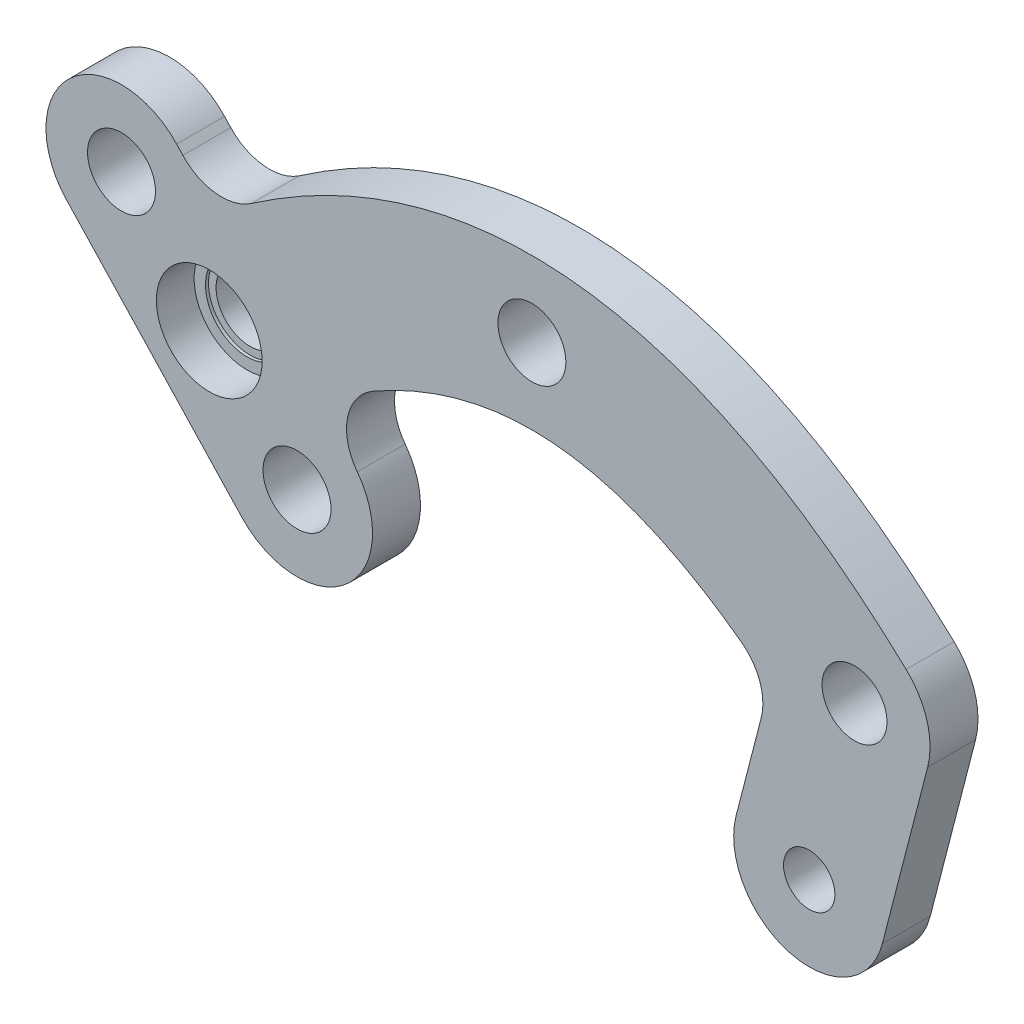
ISO-10303-21;
HEADER;
FILE_DESCRIPTION(('STEP AP214'),'2;1');
FILE_NAME('part.step','',(''),(''),'','','');
FILE_SCHEMA(('AUTOMOTIVE_DESIGN { 1 0 10303 214 1 1 1 1 }'));
ENDSEC;
DATA;
#1=APPLICATION_CONTEXT('core data for automotive mechanical design processes');
#2=APPLICATION_PROTOCOL_DEFINITION('international standard','automotive_design',2000,#1);
#3=PRODUCT_CONTEXT('',#1,'mechanical');
#4=PRODUCT('Part','Part','',(#3));
#5=PRODUCT_RELATED_PRODUCT_CATEGORY('part','',(#4));
#6=PRODUCT_DEFINITION_FORMATION('','',#4);
#7=PRODUCT_DEFINITION_CONTEXT('part definition',#1,'design');
#8=PRODUCT_DEFINITION('design','',#6,#7);
#9=PRODUCT_DEFINITION_SHAPE('','',#8);
#10=(LENGTH_UNIT() NAMED_UNIT(*) SI_UNIT(.MILLI.,.METRE.));
#11=(NAMED_UNIT(*) PLANE_ANGLE_UNIT() SI_UNIT($,.RADIAN.));
#12=(NAMED_UNIT(*) SI_UNIT($,.STERADIAN.) SOLID_ANGLE_UNIT());
#13=UNCERTAINTY_MEASURE_WITH_UNIT(LENGTH_MEASURE(1.E-05),#10,'distance_accuracy_value','');
#14=(GEOMETRIC_REPRESENTATION_CONTEXT(3) GLOBAL_UNCERTAINTY_ASSIGNED_CONTEXT((#13)) GLOBAL_UNIT_ASSIGNED_CONTEXT((#10,
#11,#12)) REPRESENTATION_CONTEXT('',''));
#15=CARTESIAN_POINT('',(0.,0.,0.));
#16=DIRECTION('',(0.,0.,1.));
#17=DIRECTION('',(1.,0.,0.));
#18=AXIS2_PLACEMENT_3D('',#15,#16,#17);
#19=CARTESIAN_POINT('',(0.,0.,-1.5875));
#20=DIRECTION('',(0.,0.,1.));
#21=DIRECTION('',(1.,0.,0.));
#22=AXIS2_PLACEMENT_3D('',#19,#20,#21);
#23=PLANE('',#22);
#24=CARTESIAN_POINT('',(21.36,-10.,-1.5875));
#25=DIRECTION('',(0.,0.,1.));
#26=DIRECTION('',(1.,0.,0.));
#27=AXIS2_PLACEMENT_3D('',#24,#25,#26);
#28=CIRCLE('',#27,2.75);
#29=CARTESIAN_POINT('',(24.11,-10.,-1.5875));
#30=VERTEX_POINT('',#29);
#31=EDGE_CURVE('E192',#30,#30,#28,.F.);
#32=ORIENTED_EDGE('',*,*,#31,.F.);
#33=EDGE_LOOP('',(#32));
#34=FACE_BOUND('',#33,.T.);
#35=CARTESIAN_POINT('',(18.36,-21.6189500386222,-1.5875));
#36=DIRECTION('',(0.,0.,-1.));
#37=DIRECTION('',(-1.,0.,0.));
#38=AXIS2_PLACEMENT_3D('',#35,#36,#37);
#39=CIRCLE('',#38,1.7);
#40=CARTESIAN_POINT('',(16.66,-21.6189500386222,-1.5875));
#41=VERTEX_POINT('',#40);
#42=EDGE_CURVE('E570',#41,#41,#39,.T.);
#43=ORIENTED_EDGE('',*,*,#42,.F.);
#44=EDGE_LOOP('',(#43));
#45=FACE_BOUND('',#44,.T.);
#46=DIRECTION('',(0.25,0.968245836551854,0.));
#47=VECTOR('',#46,1.);
#48=CARTESIAN_POINT('',(17.6043854086204,-4.5454327671869,-1.5875));
#49=LINE('',#48,#47);
#50=CARTESIAN_POINT('',(13.5187708172407,-20.3689500386223,-1.5875));
#51=VERTEX_POINT('',#50);
#52=CARTESIAN_POINT('',(15.181366688933,-13.9297439160849,-1.5875));
#53=VERTEX_POINT('',#52);
#54=EDGE_CURVE('E302',#51,#53,#49,.T.);
#55=ORIENTED_EDGE('',*,*,#54,.T.);
#56=CARTESIAN_POINT('',(11.7925062610015,-13.0547439160849,-1.5875));
#57=DIRECTION('',(0.,0.,1.));
#58=DIRECTION('',(1.,0.,0.));
#59=AXIS2_PLACEMENT_3D('',#56,#57,#58);
#60=CIRCLE('',#59,3.5);
#61=CARTESIAN_POINT('',(13.8714595418848,-10.239081781541,-1.5875));
#62=VERTEX_POINT('',#61);
#63=EDGE_CURVE('E199',#53,#62,#60,.T.);
#64=ORIENTED_EDGE('',*,*,#63,.T.);
#65=CARTESIAN_POINT('',(-17.9425685709007,-13.649816766278,-1.5875));
#66=CARTESIAN_POINT('',(-17.5430726857818,-13.275756948751,-1.5875));
#67=CARTESIAN_POINT('',(-16.7212792004638,-12.5301144959242,-1.5875));
#68=CARTESIAN_POINT('',(-15.1194822649109,-11.1715962935639,-1.5875));
#69=CARTESIAN_POINT('',(-13.1369844739387,-9.66413215948502,-1.5875));
#70=CARTESIAN_POINT('',(-10.8152020856161,-8.17139279210594,-1.5875));
#71=CARTESIAN_POINT('',(-7.79481806162839,-6.58291593418248,-1.5875));
#72=CARTESIAN_POINT('',(-4.17067918338198,-5.32148120499988,-1.5875));
#73=CARTESIAN_POINT('',(0.,-4.83925939750006,-1.5875));
#74=CARTESIAN_POINT('',(4.17067918338198,-5.32148120499988,-1.5875));
#75=CARTESIAN_POINT('',(7.79481806162839,-6.58291593418248,-1.5875));
#76=CARTESIAN_POINT('',(10.8152020856161,-8.17139279210594,-1.5875));
#77=CARTESIAN_POINT('',(13.1369844739387,-9.66413215948502,-1.5875));
#78=CARTESIAN_POINT('',(15.1194822649109,-11.1715962935639,-1.5875));
#79=CARTESIAN_POINT('',(16.7212792004638,-12.5301144959242,-1.5875));
#80=CARTESIAN_POINT('',(17.5430726857818,-13.275756948751,-1.5875));
#81=CARTESIAN_POINT('',(17.9425685709007,-13.649816766278,-1.5875));
#82=B_SPLINE_CURVE_WITH_KNOTS('',3,(#65,#66,#67,#68,#69,#70,#71,#72,#73,#74,#75,#76,#77,#78,#79,
#80,#81),.UNSPECIFIED.,.F.,.F.,(4,1,1,1,1,1,1,1,1,1,1,1,1,1,4),(0.,0.03125,0.0625,0.125,0.1875,
0.25,0.375,0.5,0.625,0.75,0.8125,0.875,0.9375,0.96875,1.),.UNSPECIFIED.);
#83=CARTESIAN_POINT('',(-10.5009094068875,-8.03488231582913,-1.5875));
#84=VERTEX_POINT('',#83);
#85=EDGE_CURVE('E441',#84,#62,#82,.T.);
#86=ORIENTED_EDGE('',*,*,#85,.F.);
#87=CARTESIAN_POINT('',(-8.77089976969667,-11.0774251101423,-1.5875));
#88=DIRECTION('',(0.,0.,1.));
#89=DIRECTION('',(1.,0.,0.));
#90=AXIS2_PLACEMENT_3D('',#87,#88,#89);
#91=CIRCLE('',#90,3.5);
#92=CARTESIAN_POINT('',(-11.5624449229815,-13.1886512129489,-1.5875));
#93=VERTEX_POINT('',#92);
#94=EDGE_CURVE('E519',#84,#93,#91,.T.);
#95=ORIENTED_EDGE('',*,*,#94,.T.);
#96=CARTESIAN_POINT('',(-15.5503665705312,-16.2046885026727,-1.5875));
#97=DIRECTION('',(0.,0.,-1.));
#98=DIRECTION('',(-1.,0.,0.));
#99=AXIS2_PLACEMENT_3D('',#96,#97,#98);
#100=CIRCLE('',#99,5.);
#101=CARTESIAN_POINT('',(-19.2001833368092,-19.622119931772,-1.5875));
#102=VERTEX_POINT('',#101);
#103=EDGE_CURVE('E345',#93,#102,#100,.T.);
#104=ORIENTED_EDGE('',*,*,#103,.T.);
#105=DIRECTION('',(-0.68348628581986,0.729963353255608,0.));
#106=VECTOR('',#105,1.);
#107=CARTESIAN_POINT('',(-28.4272481953773,-9.76761466282125,-1.5875));
#108=LINE('',#107,#106);
#109=CARTESIAN_POINT('',(-30.8194501957469,-7.21274292642662,-1.5875));
#110=VERTEX_POINT('',#109);
#111=EDGE_CURVE('E475',#102,#110,#108,.T.);
#112=ORIENTED_EDGE('',*,*,#111,.T.);
#113=CARTESIAN_POINT('',(-27.1696334294688,-3.79531149732732,-1.5875));
#114=DIRECTION('',(0.,0.,1.));
#115=DIRECTION('',(1.,0.,0.));
#116=AXIS2_PLACEMENT_3D('',#113,#114,#115);
#117=CIRCLE('',#116,5.);
#118=CARTESIAN_POINT('',(-23.5198166631908,-0.377880068228026,-1.5875));
#119=VERTEX_POINT('',#118);
#120=EDGE_CURVE('E478',#119,#110,#117,.T.);
#121=ORIENTED_EDGE('',*,*,#120,.F.);
#122=DIRECTION('',(-0.683486285819859,0.729963353255609,0.));
#123=VECTOR('',#122,1.);
#124=CARTESIAN_POINT('',(-21.1276146628213,-2.93275180462266,-1.5875));
#125=LINE('',#124,#123);
#126=CARTESIAN_POINT('',(-23.1088113192402,-0.816833775567268,-1.5875));
#127=VERTEX_POINT('',#126);
#128=EDGE_CURVE('E461',#127,#119,#125,.T.);
#129=ORIENTED_EDGE('',*,*,#128,.F.);
#130=CARTESIAN_POINT('',(-20.5539395828455,1.57536822480223,-1.5875));
#131=DIRECTION('',(0.,0.,1.));
#132=DIRECTION('',(1.,0.,0.));
#133=AXIS2_PLACEMENT_3D('',#130,#131,#132);
#134=CIRCLE('',#133,3.5);
#135=CARTESIAN_POINT('',(-18.5671163611911,-1.30604349272353,-1.5875));
#136=VERTEX_POINT('',#135);
#137=EDGE_CURVE('E513',#127,#136,#134,.T.);
#138=ORIENTED_EDGE('',*,*,#137,.T.);
#139=CARTESIAN_POINT('',(-24.7774314290993,-6.35018323372195,-1.5875));
#140=CARTESIAN_POINT('',(-24.2998102513977,-5.90297239317743,-1.5875));
#141=CARTESIAN_POINT('',(-23.3228949597084,-5.01651392990913,-1.5875));
#142=CARTESIAN_POINT('',(-21.3738810598693,-3.36280289341278,-1.5875));
#143=CARTESIAN_POINT('',(-18.9018748021789,-1.48063302855797,-1.5875));
#144=CARTESIAN_POINT('',(-15.8850966754007,0.462779531041348,-1.5875));
#145=CARTESIAN_POINT('',(-11.7850099244528,2.6247446642725,-1.5875));
#146=CARTESIAN_POINT('',(-6.5093751368029,4.4880889395126,-1.5875));
#147=CARTESIAN_POINT('',(0.,5.2559555302437,-1.5875));
#148=CARTESIAN_POINT('',(6.5093751368029,4.4880889395126,-1.5875));
#149=CARTESIAN_POINT('',(11.7850099244528,2.62474466427251,-1.5875));
#150=CARTESIAN_POINT('',(15.8850966754007,0.462779531041344,-1.5875));
#151=CARTESIAN_POINT('',(18.9018748021789,-1.48063302855797,-1.5875));
#152=CARTESIAN_POINT('',(21.3738810598693,-3.36280289341278,-1.5875));
#153=CARTESIAN_POINT('',(23.3228949597084,-5.01651392990913,-1.5875));
#154=CARTESIAN_POINT('',(24.2998102513977,-5.90297239317743,-1.5875));
#155=CARTESIAN_POINT('',(24.7774314290993,-6.35018323372195,-1.5875));
#156=B_SPLINE_CURVE_WITH_KNOTS('',3,(#139,#140,#141,#142,#143,#144,#145,#146,#147,#148,#149,
#150,#151,#152,#153,#154,#155),.UNSPECIFIED.,.F.,.F.,(4,1,1,1,1,1,1,1,1,1,1,1,1,1,4),(0.,
0.03125,0.0625,0.125,0.1875,0.25,0.375,0.5,0.625,0.75,0.8125,0.875,0.9375,0.96875,1.),.UNSPECIFIED.);
#157=CARTESIAN_POINT('',(24.7774314290993,-6.35018323372195,-1.5875));
#158=VERTEX_POINT('',#157);
#159=EDGE_CURVE('E436',#136,#158,#156,.T.);
#160=ORIENTED_EDGE('',*,*,#159,.T.);
#161=CARTESIAN_POINT('',(21.36,-10.,-1.5875));
#162=DIRECTION('',(0.,0.,1.));
#163=DIRECTION('',(1.,0.,0.));
#164=AXIS2_PLACEMENT_3D('',#161,#162,#163);
#165=CIRCLE('',#164,5.);
#166=CARTESIAN_POINT('',(26.2012291827593,-11.25,-1.5875));
#167=VERTEX_POINT('',#166);
#168=EDGE_CURVE('E353',#167,#158,#165,.T.);
#169=ORIENTED_EDGE('',*,*,#168,.F.);
#170=DIRECTION('',(0.25,0.968245836551854,0.));
#171=VECTOR('',#170,1.);
#172=CARTESIAN_POINT('',(27.2868437741389,-7.0454327671869,-1.5875));
#173=LINE('',#172,#171);
#174=CARTESIAN_POINT('',(23.2012291827593,-22.8689500386223,-1.5875));
#175=VERTEX_POINT('',#174);
#176=EDGE_CURVE('E292',#175,#167,#173,.T.);
#177=ORIENTED_EDGE('',*,*,#176,.F.);
#178=CARTESIAN_POINT('',(18.36,-21.6189500386222,-1.5875));
#179=DIRECTION('',(0.,0.,-1.));
#180=DIRECTION('',(-1.,0.,0.));
#181=AXIS2_PLACEMENT_3D('',#178,#179,#180);
#182=CIRCLE('',#181,5.);
#183=EDGE_CURVE('E288',#51,#175,#182,.F.);
#184=ORIENTED_EDGE('',*,*,#183,.F.);
#185=EDGE_LOOP('',(#55,#64,#86,#95,#104,#112,#121,#129,#138,#160,#169,#177,#184));
#186=FACE_BOUND('',#185,.T.);
#187=CARTESIAN_POINT('',(0.,0.,-1.5875));
#188=DIRECTION('',(0.,0.,1.));
#189=DIRECTION('',(1.,0.,0.));
#190=AXIS2_PLACEMENT_3D('',#187,#188,#189);
#191=CIRCLE('',#190,2.25);
#192=CARTESIAN_POINT('',(2.25,0.,-1.5875));
#193=VERTEX_POINT('',#192);
#194=EDGE_CURVE('E313',#193,#193,#191,.T.);
#195=ORIENTED_EDGE('',*,*,#194,.T.);
#196=EDGE_LOOP('',(#195));
#197=FACE_BOUND('',#196,.T.);
#198=CARTESIAN_POINT('',(-15.5503665705312,-16.2046885026727,-1.5875));
#199=DIRECTION('',(0.,0.,1.));
#200=DIRECTION('',(1.,0.,0.));
#201=AXIS2_PLACEMENT_3D('',#198,#199,#200);
#202=CIRCLE('',#201,2.25);
#203=CARTESIAN_POINT('',(-13.3003665705312,-16.2046885026727,-1.5875));
#204=VERTEX_POINT('',#203);
#205=EDGE_CURVE('E333',#204,#204,#202,.T.);
#206=ORIENTED_EDGE('',*,*,#205,.T.);
#207=EDGE_LOOP('',(#206));
#208=FACE_BOUND('',#207,.T.);
#209=CARTESIAN_POINT('',(-27.1696334294688,-3.79531149732732,-1.5875));
#210=DIRECTION('',(0.,0.,1.));
#211=DIRECTION('',(1.,0.,0.));
#212=AXIS2_PLACEMENT_3D('',#209,#210,#211);
#213=CIRCLE('',#212,2.25);
#214=CARTESIAN_POINT('',(-24.9196334294688,-3.79531149732732,-1.5875));
#215=VERTEX_POINT('',#214);
#216=EDGE_CURVE('E341',#215,#215,#213,.T.);
#217=ORIENTED_EDGE('',*,*,#216,.T.);
#218=EDGE_LOOP('',(#217));
#219=FACE_BOUND('',#218,.T.);
#220=CARTESIAN_POINT('',(-21.3599999993473,-9.99999999938886,-1.5875));
#221=DIRECTION('',(0.,0.,1.));
#222=DIRECTION('',(1.,0.,0.));
#223=AXIS2_PLACEMENT_3D('',#220,#221,#222);
#224=CIRCLE('',#223,3.);
#225=CARTESIAN_POINT('',(-18.3599999993473,-9.99999999938886,-1.5875));
#226=VERTEX_POINT('',#225);
#227=EDGE_CURVE('E12',#226,#226,#224,.F.);
#228=ORIENTED_EDGE('',*,*,#227,.F.);
#229=EDGE_LOOP('',(#228));
#230=FACE_BOUND('',#229,.T.);
#231=ADVANCED_FACE('F183',(#34,#45,#186,#197,#208,#219,#230),#23,.F.);
#232=CARTESIAN_POINT('',(-21.3599999993473,-9.99999999938886,1.5875));
#233=DIRECTION('',(0.,0.,1.));
#234=DIRECTION('',(1.,0.,0.));
#235=AXIS2_PLACEMENT_3D('',#232,#233,#234);
#236=CYLINDRICAL_SURFACE('',#235,2.25);
#237=CARTESIAN_POINT('',(-21.3599999993473,-9.99999999938886,-1.1125));
#238=DIRECTION('',(0.,0.,1.));
#239=DIRECTION('',(1.,0.,0.));
#240=AXIS2_PLACEMENT_3D('',#237,#238,#239);
#241=CIRCLE('',#240,2.25);
#242=CARTESIAN_POINT('',(-19.1099999993473,-9.99999999938886,-1.1125));
#243=VERTEX_POINT('',#242);
#244=EDGE_CURVE('E531',#243,#243,#241,.F.);
#245=ORIENTED_EDGE('',*,*,#244,.F.);
#246=EDGE_LOOP('',(#245));
#247=FACE_BOUND('',#246,.T.);
#248=CARTESIAN_POINT('',(-21.3599999993473,-9.99999999938886,-3.0875));
#249=DIRECTION('',(0.,0.,-1.));
#250=DIRECTION('',(-1.,0.,0.));
#251=AXIS2_PLACEMENT_3D('',#248,#249,#250);
#252=CIRCLE('',#251,2.25);
#253=CARTESIAN_POINT('',(-23.6099999993473,-9.99999999938886,-3.0875));
#254=VERTEX_POINT('',#253);
#255=EDGE_CURVE('E881',#254,#254,#252,.T.);
#256=ORIENTED_EDGE('',*,*,#255,.T.);
#257=EDGE_LOOP('',(#256));
#258=FACE_BOUND('',#257,.T.);
#259=ADVANCED_FACE('F367',(#247,#258),#236,.F.);
#260=CARTESIAN_POINT('',(-24.7774314290993,-6.35018323372195,1.5875));
#261=CARTESIAN_POINT('',(-24.2998102513977,-5.90297239317743,1.5875));
#262=CARTESIAN_POINT('',(-23.3228949597084,-5.01651392990913,1.5875));
#263=CARTESIAN_POINT('',(-21.3738810598693,-3.36280289341278,1.5875));
#264=CARTESIAN_POINT('',(-18.9018748021789,-1.48063302855797,1.5875));
#265=CARTESIAN_POINT('',(-15.8850966754007,0.462779531041348,1.5875));
#266=CARTESIAN_POINT('',(-11.7850099244528,2.6247446642725,1.5875));
#267=CARTESIAN_POINT('',(-6.5093751368029,4.4880889395126,1.5875));
#268=CARTESIAN_POINT('',(0.,5.2559555302437,1.5875));
#269=CARTESIAN_POINT('',(6.5093751368029,4.4880889395126,1.5875));
#270=CARTESIAN_POINT('',(11.7850099244528,2.62474466427251,1.5875));
#271=CARTESIAN_POINT('',(15.8850966754007,0.462779531041344,1.5875));
#272=CARTESIAN_POINT('',(18.9018748021789,-1.48063302855797,1.5875));
#273=CARTESIAN_POINT('',(21.3738810598693,-3.36280289341278,1.5875));
#274=CARTESIAN_POINT('',(23.3228949597084,-5.01651392990913,1.5875));
#275=CARTESIAN_POINT('',(24.2998102513977,-5.90297239317743,1.5875));
#276=CARTESIAN_POINT('',(24.7774314290993,-6.35018323372195,1.5875));
#277=B_SPLINE_CURVE_WITH_KNOTS('',3,(#260,#261,#262,#263,#264,#265,#266,#267,#268,#269,#270,
#271,#272,#273,#274,#275,#276),.UNSPECIFIED.,.F.,.F.,(4,1,1,1,1,1,1,1,1,1,1,1,1,1,4),(0.,
0.03125,0.0625,0.125,0.1875,0.25,0.375,0.5,0.625,0.75,0.8125,0.875,0.9375,0.96875,1.),.UNSPECIFIED.);
#278=DIRECTION('',(0.,0.,-1.));
#279=VECTOR('',#278,1.);
#280=SURFACE_OF_LINEAR_EXTRUSION('',#277,#279);
#281=ORIENTED_EDGE('',*,*,#159,.F.);
#282=DIRECTION('',(0.,0.,-1.));
#283=VECTOR('',#282,1.);
#284=CARTESIAN_POINT('',(-18.5671163611911,-1.30604349272352,-1.5875));
#285=LINE('',#284,#283);
#286=CARTESIAN_POINT('',(-18.5671163611911,-1.30604349272353,1.5875));
#287=VERTEX_POINT('',#286);
#288=EDGE_CURVE('E497',#136,#287,#285,.F.);
#289=ORIENTED_EDGE('',*,*,#288,.T.);
#290=CARTESIAN_POINT('',(24.7774314290993,-6.35018323372195,1.5875));
#291=VERTEX_POINT('',#290);
#292=EDGE_CURVE('E346',#287,#291,#277,.T.);
#293=ORIENTED_EDGE('',*,*,#292,.T.);
#294=DIRECTION('',(0.,0.,-1.));
#295=VECTOR('',#294,1.);
#296=CARTESIAN_POINT('',(24.7774314290993,-6.35018323372195,1.5875));
#297=LINE('',#296,#295);
#298=EDGE_CURVE('E428',#291,#158,#297,.T.);
#299=ORIENTED_EDGE('',*,*,#298,.T.);
#300=EDGE_LOOP('',(#281,#289,#293,#299));
#301=FACE_BOUND('',#300,.T.);
#302=ADVANCED_FACE('F362',(#301),#280,.T.);
#303=CARTESIAN_POINT('',(-17.9425685709007,-13.649816766278,1.5875));
#304=CARTESIAN_POINT('',(-17.5430726857818,-13.275756948751,1.5875));
#305=CARTESIAN_POINT('',(-16.7212792004638,-12.5301144959242,1.5875));
#306=CARTESIAN_POINT('',(-15.1194822649109,-11.1715962935639,1.5875));
#307=CARTESIAN_POINT('',(-13.1369844739387,-9.66413215948502,1.5875));
#308=CARTESIAN_POINT('',(-10.8152020856161,-8.17139279210594,1.5875));
#309=CARTESIAN_POINT('',(-7.79481806162839,-6.58291593418248,1.5875));
#310=CARTESIAN_POINT('',(-4.17067918338198,-5.32148120499988,1.5875));
#311=CARTESIAN_POINT('',(0.,-4.83925939750006,1.5875));
#312=CARTESIAN_POINT('',(4.17067918338198,-5.32148120499988,1.5875));
#313=CARTESIAN_POINT('',(7.79481806162839,-6.58291593418248,1.5875));
#314=CARTESIAN_POINT('',(10.8152020856161,-8.17139279210594,1.5875));
#315=CARTESIAN_POINT('',(13.1369844739387,-9.66413215948502,1.5875));
#316=CARTESIAN_POINT('',(15.1194822649109,-11.1715962935639,1.5875));
#317=CARTESIAN_POINT('',(16.7212792004638,-12.5301144959242,1.5875));
#318=CARTESIAN_POINT('',(17.5430726857818,-13.275756948751,1.5875));
#319=CARTESIAN_POINT('',(17.9425685709007,-13.649816766278,1.5875));
#320=B_SPLINE_CURVE_WITH_KNOTS('',3,(#303,#304,#305,#306,#307,#308,#309,#310,#311,#312,#313,
#314,#315,#316,#317,#318,#319),.UNSPECIFIED.,.F.,.F.,(4,1,1,1,1,1,1,1,1,1,1,1,1,1,4),(0.,
0.03125,0.0625,0.125,0.1875,0.25,0.375,0.5,0.625,0.75,0.8125,0.875,0.9375,0.96875,1.),.UNSPECIFIED.);
#321=DIRECTION('',(0.,0.,-1.));
#322=VECTOR('',#321,1.);
#323=SURFACE_OF_LINEAR_EXTRUSION('',#320,#322);
#324=CARTESIAN_POINT('',(-10.5009094068875,-8.03488231582913,1.5875));
#325=VERTEX_POINT('',#324);
#326=CARTESIAN_POINT('',(13.8714595418848,-10.239081781541,1.5875));
#327=VERTEX_POINT('',#326);
#328=EDGE_CURVE('E352',#325,#327,#320,.T.);
#329=ORIENTED_EDGE('',*,*,#328,.F.);
#330=DIRECTION('',(0.,0.,-1.));
#331=VECTOR('',#330,1.);
#332=CARTESIAN_POINT('',(-10.5009094068875,-8.03488231582913,1.5875));
#333=LINE('',#332,#331);
#334=EDGE_CURVE('E503',#325,#84,#333,.T.);
#335=ORIENTED_EDGE('',*,*,#334,.T.);
#336=ORIENTED_EDGE('',*,*,#85,.T.);
#337=DIRECTION('',(0.,0.,-1.));
#338=VECTOR('',#337,1.);
#339=CARTESIAN_POINT('',(13.8714595418848,-10.239081781541,-1.5875));
#340=LINE('',#339,#338);
#341=EDGE_CURVE('E500',#62,#327,#340,.F.);
#342=ORIENTED_EDGE('',*,*,#341,.T.);
#343=EDGE_LOOP('',(#329,#335,#336,#342));
#344=FACE_BOUND('',#343,.T.);
#345=ADVANCED_FACE('F366',(#344),#323,.F.);
#346=CARTESIAN_POINT('',(21.36,-10.,1.5875));
#347=DIRECTION('',(0.,0.,-1.));
#348=DIRECTION('',(-1.,0.,0.));
#349=AXIS2_PLACEMENT_3D('',#346,#347,#348);
#350=CYLINDRICAL_SURFACE('',#349,5.);
#351=CARTESIAN_POINT('',(21.36,-10.,1.5875));
#352=DIRECTION('',(0.,0.,1.));
#353=DIRECTION('',(1.,0.,0.));
#354=AXIS2_PLACEMENT_3D('',#351,#352,#353);
#355=CIRCLE('',#354,5.);
#356=CARTESIAN_POINT('',(26.2012291827593,-11.25,1.5875));
#357=VERTEX_POINT('',#356);
#358=EDGE_CURVE('E424',#357,#291,#355,.T.);
#359=ORIENTED_EDGE('',*,*,#358,.F.);
#360=DIRECTION('',(0.,0.,-1.));
#361=VECTOR('',#360,1.);
#362=CARTESIAN_POINT('',(26.2012291827593,-11.25,21.6150258635163));
#363=LINE('',#362,#361);
#364=EDGE_CURVE('E298',#357,#167,#363,.T.);
#365=ORIENTED_EDGE('',*,*,#364,.T.);
#366=ORIENTED_EDGE('',*,*,#168,.T.);
#367=ORIENTED_EDGE('',*,*,#298,.F.);
#368=EDGE_LOOP('',(#359,#365,#366,#367));
#369=FACE_BOUND('',#368,.T.);
#370=ADVANCED_FACE('F376',(#369),#350,.T.);
#371=CARTESIAN_POINT('',(0.,0.,1.5875));
#372=DIRECTION('',(0.,0.,1.));
#373=DIRECTION('',(1.,0.,0.));
#374=AXIS2_PLACEMENT_3D('',#371,#372,#373);
#375=PLANE('',#374);
#376=CARTESIAN_POINT('',(-21.3599999993473,-9.99999999938886,1.5875));
#377=DIRECTION('',(0.,0.,1.));
#378=DIRECTION('',(1.,0.,0.));
#379=AXIS2_PLACEMENT_3D('',#376,#377,#378);
#380=CIRCLE('',#379,3.5);
#381=CARTESIAN_POINT('',(-17.8599999993473,-9.99999999938886,1.5875));
#382=VERTEX_POINT('',#381);
#383=EDGE_CURVE('E534',#382,#382,#380,.T.);
#384=ORIENTED_EDGE('',*,*,#383,.F.);
#385=EDGE_LOOP('',(#384));
#386=FACE_BOUND('',#385,.T.);
#387=CARTESIAN_POINT('',(21.36,-10.,1.5875));
#388=DIRECTION('',(0.,0.,-1.));
#389=DIRECTION('',(-1.,0.,0.));
#390=AXIS2_PLACEMENT_3D('',#387,#388,#389);
#391=CIRCLE('',#390,2.15);
#392=CARTESIAN_POINT('',(19.21,-10.,1.5875));
#393=VERTEX_POINT('',#392);
#394=EDGE_CURVE('E566',#393,#393,#391,.T.);
#395=ORIENTED_EDGE('',*,*,#394,.T.);
#396=EDGE_LOOP('',(#395));
#397=FACE_BOUND('',#396,.T.);
#398=CARTESIAN_POINT('',(18.36,-21.6189500386222,1.5875));
#399=DIRECTION('',(0.,0.,-1.));
#400=DIRECTION('',(-1.,0.,0.));
#401=AXIS2_PLACEMENT_3D('',#398,#399,#400);
#402=CIRCLE('',#401,1.7);
#403=CARTESIAN_POINT('',(16.66,-21.6189500386222,1.5875));
#404=VERTEX_POINT('',#403);
#405=EDGE_CURVE('E324',#404,#404,#402,.T.);
#406=ORIENTED_EDGE('',*,*,#405,.T.);
#407=EDGE_LOOP('',(#406));
#408=FACE_BOUND('',#407,.T.);
#409=CARTESIAN_POINT('',(-15.5503665705312,-16.2046885026727,1.5875));
#410=DIRECTION('',(0.,0.,-1.));
#411=DIRECTION('',(-1.,0.,0.));
#412=AXIS2_PLACEMENT_3D('',#409,#410,#411);
#413=CIRCLE('',#412,5.);
#414=CARTESIAN_POINT('',(-11.5624449229815,-13.1886512129489,1.5875));
#415=VERTEX_POINT('',#414);
#416=CARTESIAN_POINT('',(-19.2001833368092,-19.622119931772,1.5875));
#417=VERTEX_POINT('',#416);
#418=EDGE_CURVE('E460',#415,#417,#413,.T.);
#419=ORIENTED_EDGE('',*,*,#418,.F.);
#420=CARTESIAN_POINT('',(-8.77089976969667,-11.0774251101423,1.5875));
#421=DIRECTION('',(0.,0.,1.));
#422=DIRECTION('',(1.,0.,0.));
#423=AXIS2_PLACEMENT_3D('',#420,#421,#422);
#424=CIRCLE('',#423,3.5);
#425=EDGE_CURVE('E522',#415,#325,#424,.F.);
#426=ORIENTED_EDGE('',*,*,#425,.T.);
#427=ORIENTED_EDGE('',*,*,#328,.T.);
#428=CARTESIAN_POINT('',(11.7925062610015,-13.0547439160849,1.5875));
#429=DIRECTION('',(0.,0.,1.));
#430=DIRECTION('',(1.,0.,0.));
#431=AXIS2_PLACEMENT_3D('',#428,#429,#430);
#432=CIRCLE('',#431,3.5);
#433=CARTESIAN_POINT('',(15.181366688933,-13.9297439160849,1.5875));
#434=VERTEX_POINT('',#433);
#435=EDGE_CURVE('E207',#327,#434,#432,.F.);
#436=ORIENTED_EDGE('',*,*,#435,.T.);
#437=DIRECTION('',(0.25,0.968245836551854,0.));
#438=VECTOR('',#437,1.);
#439=CARTESIAN_POINT('',(17.6043854086204,-4.5454327671869,1.5875));
#440=LINE('',#439,#438);
#441=CARTESIAN_POINT('',(13.5187708172407,-20.3689500386223,1.5875));
#442=VERTEX_POINT('',#441);
#443=EDGE_CURVE('E307',#442,#434,#440,.T.);
#444=ORIENTED_EDGE('',*,*,#443,.F.);
#445=CARTESIAN_POINT('',(18.36,-21.6189500386222,1.5875));
#446=DIRECTION('',(0.,0.,1.));
#447=DIRECTION('',(1.,0.,0.));
#448=AXIS2_PLACEMENT_3D('',#445,#446,#447);
#449=CIRCLE('',#448,5.);
#450=CARTESIAN_POINT('',(23.2012291827593,-22.8689500386223,1.5875));
#451=VERTEX_POINT('',#450);
#452=EDGE_CURVE('E285',#442,#451,#449,.T.);
#453=ORIENTED_EDGE('',*,*,#452,.T.);
#454=DIRECTION('',(0.25,0.968245836551854,0.));
#455=VECTOR('',#454,1.);
#456=CARTESIAN_POINT('',(27.2868437741389,-7.0454327671869,1.5875));
#457=LINE('',#456,#455);
#458=EDGE_CURVE('E295',#451,#357,#457,.T.);
#459=ORIENTED_EDGE('',*,*,#458,.T.);
#460=ORIENTED_EDGE('',*,*,#358,.T.);
#461=ORIENTED_EDGE('',*,*,#292,.F.);
#462=CARTESIAN_POINT('',(-20.5539395828455,1.57536822480223,1.5875));
#463=DIRECTION('',(0.,0.,1.));
#464=DIRECTION('',(1.,0.,0.));
#465=AXIS2_PLACEMENT_3D('',#462,#463,#464);
#466=CIRCLE('',#465,3.5);
#467=CARTESIAN_POINT('',(-23.1088113192402,-0.816833775567268,1.5875));
#468=VERTEX_POINT('',#467);
#469=EDGE_CURVE('E516',#287,#468,#466,.F.);
#470=ORIENTED_EDGE('',*,*,#469,.T.);
#471=DIRECTION('',(0.68348628581986,-0.729963353255609,0.));
#472=VECTOR('',#471,1.);
#473=CARTESIAN_POINT('',(-21.1276146628213,-2.93275180462266,1.5875));
#474=LINE('',#473,#472);
#475=CARTESIAN_POINT('',(-23.5198166631908,-0.377880068228026,1.5875));
#476=VERTEX_POINT('',#475);
#477=EDGE_CURVE('E456',#476,#468,#474,.T.);
#478=ORIENTED_EDGE('',*,*,#477,.F.);
#479=CARTESIAN_POINT('',(-27.1696334294688,-3.79531149732732,1.5875));
#480=DIRECTION('',(0.,0.,1.));
#481=DIRECTION('',(1.,0.,0.));
#482=AXIS2_PLACEMENT_3D('',#479,#480,#481);
#483=CIRCLE('',#482,5.);
#484=CARTESIAN_POINT('',(-30.8194501957469,-7.21274292642662,1.5875));
#485=VERTEX_POINT('',#484);
#486=EDGE_CURVE('E468',#476,#485,#483,.T.);
#487=ORIENTED_EDGE('',*,*,#486,.T.);
#488=DIRECTION('',(0.68348628581986,-0.729963353255609,0.));
#489=VECTOR('',#488,1.);
#490=CARTESIAN_POINT('',(-21.5923853371787,-17.0672481953773,1.5875));
#491=LINE('',#490,#489);
#492=EDGE_CURVE('E464',#485,#417,#491,.T.);
#493=ORIENTED_EDGE('',*,*,#492,.T.);
#494=EDGE_LOOP('',(#419,#426,#427,#436,#444,#453,#459,#460,#461,#470,#478,#487,#493));
#495=FACE_BOUND('',#494,.T.);
#496=CARTESIAN_POINT('',(0.,0.,1.5875));
#497=DIRECTION('',(0.,0.,1.));
#498=DIRECTION('',(1.,0.,0.));
#499=AXIS2_PLACEMENT_3D('',#496,#497,#498);
#500=CIRCLE('',#499,2.25);
#501=CARTESIAN_POINT('',(2.25,0.,1.5875));
#502=VERTEX_POINT('',#501);
#503=EDGE_CURVE('E309',#502,#502,#500,.T.);
#504=ORIENTED_EDGE('',*,*,#503,.F.);
#505=EDGE_LOOP('',(#504));
#506=FACE_BOUND('',#505,.T.);
#507=CARTESIAN_POINT('',(-15.5503665705312,-16.2046885026727,1.5875));
#508=DIRECTION('',(0.,0.,1.));
#509=DIRECTION('',(1.,0.,0.));
#510=AXIS2_PLACEMENT_3D('',#507,#508,#509);
#511=CIRCLE('',#510,2.25);
#512=CARTESIAN_POINT('',(-13.3003665705312,-16.2046885026727,1.5875));
#513=VERTEX_POINT('',#512);
#514=EDGE_CURVE('E329',#513,#513,#511,.T.);
#515=ORIENTED_EDGE('',*,*,#514,.F.);
#516=EDGE_LOOP('',(#515));
#517=FACE_BOUND('',#516,.T.);
#518=CARTESIAN_POINT('',(-27.1696334294688,-3.79531149732732,1.5875));
#519=DIRECTION('',(0.,0.,1.));
#520=DIRECTION('',(1.,0.,0.));
#521=AXIS2_PLACEMENT_3D('',#518,#519,#520);
#522=CIRCLE('',#521,2.25);
#523=CARTESIAN_POINT('',(-24.9196334294688,-3.79531149732732,1.5875));
#524=VERTEX_POINT('',#523);
#525=EDGE_CURVE('E337',#524,#524,#522,.T.);
#526=ORIENTED_EDGE('',*,*,#525,.F.);
#527=EDGE_LOOP('',(#526));
#528=FACE_BOUND('',#527,.T.);
#529=ADVANCED_FACE('F305',(#386,#397,#408,#495,#506,#517,#528),#375,.T.);
#530=CARTESIAN_POINT('',(-28.4272481953773,-9.76761466282125,1.5875));
#531=DIRECTION('',(-0.729963353255608,-0.68348628581986,0.));
#532=DIRECTION('',(0.68348628581986,-0.729963353255608,0.));
#533=AXIS2_PLACEMENT_3D('',#530,#531,#532);
#534=PLANE('',#533);
#535=DIRECTION('',(0.,0.,-1.));
#536=VECTOR('',#535,1.);
#537=CARTESIAN_POINT('',(-30.8194501957469,-7.21274292642662,1.5875));
#538=LINE('',#537,#536);
#539=EDGE_CURVE('E487',#485,#110,#538,.T.);
#540=ORIENTED_EDGE('',*,*,#539,.T.);
#541=ORIENTED_EDGE('',*,*,#111,.F.);
#542=DIRECTION('',(0.,0.,-1.));
#543=VECTOR('',#542,1.);
#544=CARTESIAN_POINT('',(-19.2001833368092,-19.622119931772,1.5875));
#545=LINE('',#544,#543);
#546=EDGE_CURVE('E472',#417,#102,#545,.T.);
#547=ORIENTED_EDGE('',*,*,#546,.F.);
#548=ORIENTED_EDGE('',*,*,#492,.F.);
#549=EDGE_LOOP('',(#540,#541,#547,#548));
#550=FACE_BOUND('',#549,.T.);
#551=ADVANCED_FACE('F380',(#550),#534,.T.);
#552=CARTESIAN_POINT('',(-27.1696334294688,-3.79531149732732,1.5875));
#553=DIRECTION('',(0.,0.,-1.));
#554=DIRECTION('',(-1.,0.,0.));
#555=AXIS2_PLACEMENT_3D('',#552,#553,#554);
#556=CYLINDRICAL_SURFACE('',#555,5.);
#557=ORIENTED_EDGE('',*,*,#120,.T.);
#558=ORIENTED_EDGE('',*,*,#539,.F.);
#559=ORIENTED_EDGE('',*,*,#486,.F.);
#560=DIRECTION('',(0.,0.,-1.));
#561=VECTOR('',#560,1.);
#562=CARTESIAN_POINT('',(-23.5198166631908,-0.377880068228026,1.5875));
#563=LINE('',#562,#561);
#564=EDGE_CURVE('E442',#476,#119,#563,.T.);
#565=ORIENTED_EDGE('',*,*,#564,.T.);
#566=EDGE_LOOP('',(#557,#558,#559,#565));
#567=FACE_BOUND('',#566,.T.);
#568=ADVANCED_FACE('F377',(#567),#556,.T.);
#569=CARTESIAN_POINT('',(-15.5503665705312,-16.2046885026727,1.5875));
#570=DIRECTION('',(0.,0.,-1.));
#571=DIRECTION('',(-1.,0.,0.));
#572=AXIS2_PLACEMENT_3D('',#569,#570,#571);
#573=CYLINDRICAL_SURFACE('',#572,5.);
#574=ORIENTED_EDGE('',*,*,#103,.F.);
#575=DIRECTION('',(0.,0.,-1.));
#576=VECTOR('',#575,1.);
#577=CARTESIAN_POINT('',(-11.5624449229815,-13.1886512129489,1.5875));
#578=LINE('',#577,#576);
#579=EDGE_CURVE('E507',#93,#415,#578,.F.);
#580=ORIENTED_EDGE('',*,*,#579,.T.);
#581=ORIENTED_EDGE('',*,*,#418,.T.);
#582=ORIENTED_EDGE('',*,*,#546,.T.);
#583=EDGE_LOOP('',(#574,#580,#581,#582));
#584=FACE_BOUND('',#583,.T.);
#585=ADVANCED_FACE('F374',(#584),#573,.T.);
#586=CARTESIAN_POINT('',(-21.1276146628213,-2.93275180462266,1.5875));
#587=DIRECTION('',(-0.729963353255609,-0.683486285819859,0.));
#588=DIRECTION('',(0.683486285819859,-0.729963353255609,0.));
#589=AXIS2_PLACEMENT_3D('',#586,#587,#588);
#590=PLANE('',#589);
#591=ORIENTED_EDGE('',*,*,#477,.T.);
#592=DIRECTION('',(0.,0.,-1.));
#593=VECTOR('',#592,1.);
#594=CARTESIAN_POINT('',(-23.1088113192402,-0.816833775567268,1.5875));
#595=LINE('',#594,#593);
#596=EDGE_CURVE('E433',#468,#127,#595,.T.);
#597=ORIENTED_EDGE('',*,*,#596,.T.);
#598=ORIENTED_EDGE('',*,*,#128,.T.);
#599=ORIENTED_EDGE('',*,*,#564,.F.);
#600=EDGE_LOOP('',(#591,#597,#598,#599));
#601=FACE_BOUND('',#600,.T.);
#602=ADVANCED_FACE('F370',(#601),#590,.F.);
#603=CARTESIAN_POINT('',(-27.1696334294688,-3.79531149732732,1.5875));
#604=DIRECTION('',(0.,0.,1.));
#605=DIRECTION('',(1.,0.,0.));
#606=AXIS2_PLACEMENT_3D('',#603,#604,#605);
#607=CYLINDRICAL_SURFACE('',#606,2.25);
#608=ORIENTED_EDGE('',*,*,#216,.F.);
#609=EDGE_LOOP('',(#608));
#610=FACE_BOUND('',#609,.T.);
#611=ORIENTED_EDGE('',*,*,#525,.T.);
#612=EDGE_LOOP('',(#611));
#613=FACE_BOUND('',#612,.T.);
#614=ADVANCED_FACE('F373',(#610,#613),#607,.F.);
#615=CARTESIAN_POINT('',(-15.5503665705312,-16.2046885026727,1.5875));
#616=DIRECTION('',(0.,0.,1.));
#617=DIRECTION('',(1.,0.,0.));
#618=AXIS2_PLACEMENT_3D('',#615,#616,#617);
#619=CYLINDRICAL_SURFACE('',#618,2.25);
#620=ORIENTED_EDGE('',*,*,#205,.F.);
#621=EDGE_LOOP('',(#620));
#622=FACE_BOUND('',#621,.T.);
#623=ORIENTED_EDGE('',*,*,#514,.T.);
#624=EDGE_LOOP('',(#623));
#625=FACE_BOUND('',#624,.T.);
#626=ADVANCED_FACE('F608',(#622,#625),#619,.F.);
#627=CARTESIAN_POINT('',(0.,0.,1.5875));
#628=DIRECTION('',(0.,0.,1.));
#629=DIRECTION('',(1.,0.,0.));
#630=AXIS2_PLACEMENT_3D('',#627,#628,#629);
#631=CYLINDRICAL_SURFACE('',#630,2.25);
#632=ORIENTED_EDGE('',*,*,#194,.F.);
#633=EDGE_LOOP('',(#632));
#634=FACE_BOUND('',#633,.T.);
#635=ORIENTED_EDGE('',*,*,#503,.T.);
#636=EDGE_LOOP('',(#635));
#637=FACE_BOUND('',#636,.T.);
#638=ADVANCED_FACE('F603',(#634,#637),#631,.F.);
#639=CARTESIAN_POINT('',(17.6043854086204,-4.5454327671869,21.6150258635163));
#640=DIRECTION('',(-0.968245836551854,0.25,0.));
#641=DIRECTION('',(-0.25,-0.968245836551854,0.));
#642=AXIS2_PLACEMENT_3D('',#639,#640,#641);
#643=PLANE('',#642);
#644=ORIENTED_EDGE('',*,*,#443,.T.);
#645=DIRECTION('',(0.,0.,-1.));
#646=VECTOR('',#645,1.);
#647=CARTESIAN_POINT('',(15.181366688933,-13.9297439160849,21.6150258635163));
#648=LINE('',#647,#646);
#649=EDGE_CURVE('E510',#434,#53,#648,.T.);
#650=ORIENTED_EDGE('',*,*,#649,.T.);
#651=ORIENTED_EDGE('',*,*,#54,.F.);
#652=DIRECTION('',(0.,0.,-1.));
#653=VECTOR('',#652,1.);
#654=CARTESIAN_POINT('',(13.5187708172407,-20.3689500386223,21.6150258635163));
#655=LINE('',#654,#653);
#656=EDGE_CURVE('E319',#442,#51,#655,.T.);
#657=ORIENTED_EDGE('',*,*,#656,.F.);
#658=EDGE_LOOP('',(#644,#650,#651,#657));
#659=FACE_BOUND('',#658,.T.);
#660=ADVANCED_FACE('F601',(#659),#643,.T.);
#661=CARTESIAN_POINT('',(18.36,-21.6189500386222,21.6150258635163));
#662=DIRECTION('',(0.,0.,-1.));
#663=DIRECTION('',(-1.,0.,0.));
#664=AXIS2_PLACEMENT_3D('',#661,#662,#663);
#665=CYLINDRICAL_SURFACE('',#664,5.);
#666=ORIENTED_EDGE('',*,*,#452,.F.);
#667=ORIENTED_EDGE('',*,*,#656,.T.);
#668=ORIENTED_EDGE('',*,*,#183,.T.);
#669=DIRECTION('',(0.,0.,-1.));
#670=VECTOR('',#669,1.);
#671=CARTESIAN_POINT('',(23.2012291827593,-22.8689500386223,21.6150258635163));
#672=LINE('',#671,#670);
#673=EDGE_CURVE('E281',#451,#175,#672,.T.);
#674=ORIENTED_EDGE('',*,*,#673,.F.);
#675=EDGE_LOOP('',(#666,#667,#668,#674));
#676=FACE_BOUND('',#675,.T.);
#677=ADVANCED_FACE('F283',(#676),#665,.T.);
#678=CARTESIAN_POINT('',(27.2868437741389,-7.0454327671869,21.6150258635163));
#679=DIRECTION('',(-0.968245836551854,0.25,0.));
#680=DIRECTION('',(-0.25,-0.968245836551854,0.));
#681=AXIS2_PLACEMENT_3D('',#678,#679,#680);
#682=PLANE('',#681);
#683=ORIENTED_EDGE('',*,*,#458,.F.);
#684=ORIENTED_EDGE('',*,*,#673,.T.);
#685=ORIENTED_EDGE('',*,*,#176,.T.);
#686=ORIENTED_EDGE('',*,*,#364,.F.);
#687=EDGE_LOOP('',(#683,#684,#685,#686));
#688=FACE_BOUND('',#687,.T.);
#689=ADVANCED_FACE('F296',(#688),#682,.F.);
#690=CARTESIAN_POINT('',(18.36,-21.6189500386222,-1.5875));
#691=DIRECTION('',(0.,0.,-1.));
#692=DIRECTION('',(-1.,0.,0.));
#693=AXIS2_PLACEMENT_3D('',#690,#691,#692);
#694=CYLINDRICAL_SURFACE('',#693,1.7);
#695=ORIENTED_EDGE('',*,*,#405,.F.);
#696=EDGE_LOOP('',(#695));
#697=FACE_BOUND('',#696,.T.);
#698=ORIENTED_EDGE('',*,*,#42,.T.);
#699=EDGE_LOOP('',(#698));
#700=FACE_BOUND('',#699,.T.);
#701=ADVANCED_FACE('F391',(#697,#700),#694,.F.);
#702=CARTESIAN_POINT('',(-20.5539395828455,1.57536822480223,0.));
#703=DIRECTION('',(0.,0.,-1.));
#704=DIRECTION('',(-1.,0.,0.));
#705=AXIS2_PLACEMENT_3D('',#702,#703,#704);
#706=CYLINDRICAL_SURFACE('',#705,3.5);
#707=ORIENTED_EDGE('',*,*,#469,.F.);
#708=ORIENTED_EDGE('',*,*,#288,.F.);
#709=ORIENTED_EDGE('',*,*,#137,.F.);
#710=ORIENTED_EDGE('',*,*,#596,.F.);
#711=EDGE_LOOP('',(#707,#708,#709,#710));
#712=FACE_BOUND('',#711,.T.);
#713=ADVANCED_FACE('F388',(#712),#706,.F.);
#714=CARTESIAN_POINT('',(-8.77089976969667,-11.0774251101423,0.));
#715=DIRECTION('',(0.,0.,-1.));
#716=DIRECTION('',(-1.,0.,0.));
#717=AXIS2_PLACEMENT_3D('',#714,#715,#716);
#718=CYLINDRICAL_SURFACE('',#717,3.5);
#719=ORIENTED_EDGE('',*,*,#425,.F.);
#720=ORIENTED_EDGE('',*,*,#579,.F.);
#721=ORIENTED_EDGE('',*,*,#94,.F.);
#722=ORIENTED_EDGE('',*,*,#334,.F.);
#723=EDGE_LOOP('',(#719,#720,#721,#722));
#724=FACE_BOUND('',#723,.T.);
#725=ADVANCED_FACE('F390',(#724),#718,.F.);
#726=CARTESIAN_POINT('',(11.7925062610015,-13.0547439160849,0.));
#727=DIRECTION('',(0.,0.,-1.));
#728=DIRECTION('',(-1.,0.,0.));
#729=AXIS2_PLACEMENT_3D('',#726,#727,#728);
#730=CYLINDRICAL_SURFACE('',#729,3.5);
#731=ORIENTED_EDGE('',*,*,#435,.F.);
#732=ORIENTED_EDGE('',*,*,#341,.F.);
#733=ORIENTED_EDGE('',*,*,#63,.F.);
#734=ORIENTED_EDGE('',*,*,#649,.F.);
#735=EDGE_LOOP('',(#731,#732,#733,#734));
#736=FACE_BOUND('',#735,.T.);
#737=ADVANCED_FACE('F185',(#736),#730,.F.);
#738=CARTESIAN_POINT('',(21.36,-10.,1.5875));
#739=DIRECTION('',(0.,0.,-1.));
#740=DIRECTION('',(-1.,0.,0.));
#741=AXIS2_PLACEMENT_3D('',#738,#739,#740);
#742=CYLINDRICAL_SURFACE('',#741,2.15);
#743=ORIENTED_EDGE('',*,*,#394,.F.);
#744=EDGE_LOOP('',(#743));
#745=FACE_BOUND('',#744,.T.);
#746=CARTESIAN_POINT('',(21.36,-10.,-2.3375));
#747=DIRECTION('',(0.,0.,-1.));
#748=DIRECTION('',(-1.,0.,0.));
#749=AXIS2_PLACEMENT_3D('',#746,#747,#748);
#750=CIRCLE('',#749,2.15);
#751=CARTESIAN_POINT('',(19.21,-10.,-2.3375));
#752=VERTEX_POINT('',#751);
#753=EDGE_CURVE('E557',#752,#752,#750,.T.);
#754=ORIENTED_EDGE('',*,*,#753,.T.);
#755=EDGE_LOOP('',(#754));
#756=FACE_BOUND('',#755,.T.);
#757=ADVANCED_FACE('F398',(#745,#756),#742,.F.);
#758=CARTESIAN_POINT('',(21.36,-10.,-2.3375));
#759=DIRECTION('',(0.,0.,-1.));
#760=DIRECTION('',(-1.,0.,0.));
#761=AXIS2_PLACEMENT_3D('',#758,#759,#760);
#762=PLANE('',#761);
#763=CARTESIAN_POINT('',(21.36,-10.,-2.3375));
#764=DIRECTION('',(0.,0.,-1.));
#765=DIRECTION('',(-1.,0.,0.));
#766=AXIS2_PLACEMENT_3D('',#763,#764,#765);
#767=CIRCLE('',#766,2.75);
#768=CARTESIAN_POINT('',(18.61,-10.,-2.3375));
#769=VERTEX_POINT('',#768);
#770=EDGE_CURVE('E562',#769,#769,#767,.T.);
#771=ORIENTED_EDGE('',*,*,#770,.T.);
#772=EDGE_LOOP('',(#771));
#773=FACE_BOUND('',#772,.T.);
#774=ORIENTED_EDGE('',*,*,#753,.F.);
#775=EDGE_LOOP('',(#774));
#776=FACE_BOUND('',#775,.T.);
#777=ADVANCED_FACE('F654',(#773,#776),#762,.T.);
#778=CARTESIAN_POINT('',(21.36,-10.,-2.3375));
#779=DIRECTION('',(0.,0.,1.));
#780=DIRECTION('',(1.,0.,0.));
#781=AXIS2_PLACEMENT_3D('',#778,#779,#780);
#782=CYLINDRICAL_SURFACE('',#781,2.75);
#783=ORIENTED_EDGE('',*,*,#770,.F.);
#784=EDGE_LOOP('',(#783));
#785=FACE_BOUND('',#784,.T.);
#786=ORIENTED_EDGE('',*,*,#31,.T.);
#787=EDGE_LOOP('',(#786));
#788=FACE_BOUND('',#787,.T.);
#789=ADVANCED_FACE('F649',(#785,#788),#782,.T.);
#790=CARTESIAN_POINT('',(-21.3599999993473,-9.99999999938886,-0.9125));
#791=DIRECTION('',(0.,0.,1.));
#792=DIRECTION('',(1.,0.,0.));
#793=AXIS2_PLACEMENT_3D('',#790,#791,#792);
#794=PLANE('',#793);
#795=CARTESIAN_POINT('',(-21.3599999993473,-9.99999999938886,-0.9125));
#796=DIRECTION('',(0.,0.,1.));
#797=DIRECTION('',(1.,0.,0.));
#798=AXIS2_PLACEMENT_3D('',#795,#796,#797);
#799=CIRCLE('',#798,2.75);
#800=CARTESIAN_POINT('',(-18.6099999993473,-9.99999999938886,-0.9125));
#801=VERTEX_POINT('',#800);
#802=EDGE_CURVE('E544',#801,#801,#799,.T.);
#803=ORIENTED_EDGE('',*,*,#802,.F.);
#804=EDGE_LOOP('',(#803));
#805=FACE_BOUND('',#804,.T.);
#806=CARTESIAN_POINT('',(-21.3599999993473,-9.99999999938886,-0.9125));
#807=DIRECTION('',(0.,0.,1.));
#808=DIRECTION('',(1.,0.,0.));
#809=AXIS2_PLACEMENT_3D('',#806,#807,#808);
#810=CIRCLE('',#809,3.5);
#811=CARTESIAN_POINT('',(-17.8599999993473,-9.99999999938886,-0.9125));
#812=VERTEX_POINT('',#811);
#813=EDGE_CURVE('E541',#812,#812,#810,.T.);
#814=ORIENTED_EDGE('',*,*,#813,.T.);
#815=EDGE_LOOP('',(#814));
#816=FACE_BOUND('',#815,.T.);
#817=ADVANCED_FACE('F646',(#805,#816),#794,.T.);
#818=CARTESIAN_POINT('',(-21.3599999993473,-9.99999999938886,-0.9125));
#819=DIRECTION('',(0.,0.,1.));
#820=DIRECTION('',(1.,0.,0.));
#821=AXIS2_PLACEMENT_3D('',#818,#819,#820);
#822=CYLINDRICAL_SURFACE('',#821,3.5);
#823=ORIENTED_EDGE('',*,*,#813,.F.);
#824=EDGE_LOOP('',(#823));
#825=FACE_BOUND('',#824,.T.);
#826=ORIENTED_EDGE('',*,*,#383,.T.);
#827=EDGE_LOOP('',(#826));
#828=FACE_BOUND('',#827,.T.);
#829=ADVANCED_FACE('F643',(#825,#828),#822,.F.);
#830=CARTESIAN_POINT('',(-21.3599999993473,-9.99999999938886,-1.1125));
#831=DIRECTION('',(0.,0.,1.));
#832=DIRECTION('',(1.,0.,0.));
#833=AXIS2_PLACEMENT_3D('',#830,#831,#832);
#834=PLANE('',#833);
#835=CARTESIAN_POINT('',(-21.3599999993473,-9.99999999938886,-1.1125));
#836=DIRECTION('',(0.,0.,1.));
#837=DIRECTION('',(1.,0.,0.));
#838=AXIS2_PLACEMENT_3D('',#835,#836,#837);
#839=CIRCLE('',#838,2.75);
#840=CARTESIAN_POINT('',(-18.6099999993473,-9.99999999938886,-1.1125));
#841=VERTEX_POINT('',#840);
#842=EDGE_CURVE('E535',#841,#841,#839,.T.);
#843=ORIENTED_EDGE('',*,*,#842,.T.);
#844=EDGE_LOOP('',(#843));
#845=FACE_BOUND('',#844,.T.);
#846=ORIENTED_EDGE('',*,*,#244,.T.);
#847=EDGE_LOOP('',(#846));
#848=FACE_BOUND('',#847,.T.);
#849=ADVANCED_FACE('F640',(#845,#848),#834,.T.);
#850=CARTESIAN_POINT('',(-21.3599999993473,-9.99999999938886,-1.1125));
#851=DIRECTION('',(0.,0.,1.));
#852=DIRECTION('',(1.,0.,0.));
#853=AXIS2_PLACEMENT_3D('',#850,#851,#852);
#854=CYLINDRICAL_SURFACE('',#853,2.75);
#855=ORIENTED_EDGE('',*,*,#842,.F.);
#856=EDGE_LOOP('',(#855));
#857=FACE_BOUND('',#856,.T.);
#858=ORIENTED_EDGE('',*,*,#802,.T.);
#859=EDGE_LOOP('',(#858));
#860=FACE_BOUND('',#859,.T.);
#861=ADVANCED_FACE('F635',(#857,#860),#854,.F.);
#862=CARTESIAN_POINT('',(-21.3599999993473,-9.99999999938886,-3.0875));
#863=DIRECTION('',(0.,0.,-1.));
#864=DIRECTION('',(-1.,0.,0.));
#865=AXIS2_PLACEMENT_3D('',#862,#863,#864);
#866=PLANE('',#865);
#867=CARTESIAN_POINT('',(-21.3599999993473,-9.99999999938886,-3.0875));
#868=DIRECTION('',(0.,0.,-1.));
#869=DIRECTION('',(-1.,0.,0.));
#870=AXIS2_PLACEMENT_3D('',#867,#868,#869);
#871=CIRCLE('',#870,3.);
#872=CARTESIAN_POINT('',(-24.3599999993473,-9.99999999938886,-3.0875));
#873=VERTEX_POINT('',#872);
#874=EDGE_CURVE('E550',#873,#873,#871,.T.);
#875=ORIENTED_EDGE('',*,*,#874,.T.);
#876=EDGE_LOOP('',(#875));
#877=FACE_BOUND('',#876,.T.);
#878=ORIENTED_EDGE('',*,*,#255,.F.);
#879=EDGE_LOOP('',(#878));
#880=FACE_BOUND('',#879,.T.);
#881=ADVANCED_FACE('F629',(#877,#880),#866,.T.);
#882=CARTESIAN_POINT('',(-21.3599999993473,-9.99999999938886,-3.0875));
#883=DIRECTION('',(0.,0.,1.));
#884=DIRECTION('',(1.,0.,0.));
#885=AXIS2_PLACEMENT_3D('',#882,#883,#884);
#886=CYLINDRICAL_SURFACE('',#885,3.);
#887=ORIENTED_EDGE('',*,*,#874,.F.);
#888=EDGE_LOOP('',(#887));
#889=FACE_BOUND('',#888,.T.);
#890=ORIENTED_EDGE('',*,*,#227,.T.);
#891=EDGE_LOOP('',(#890));
#892=FACE_BOUND('',#891,.T.);
#893=ADVANCED_FACE('F627',(#889,#892),#886,.T.);
#894=CLOSED_SHELL('',(#231,#259,#302,#345,#370,#529,#551,#568,#585,#602,#614,#626,#638,#660,
#677,#689,#701,#713,#725,#737,#757,#777,#789,#817,#829,#849,#861,#881,#893));
#895=MANIFOLD_SOLID_BREP('B2',#894);
#896=ADVANCED_BREP_SHAPE_REPRESENTATION('',(#18,#895),#14);
#897=SHAPE_DEFINITION_REPRESENTATION(#9,#896);
ENDSEC;
END-ISO-10303-21;
